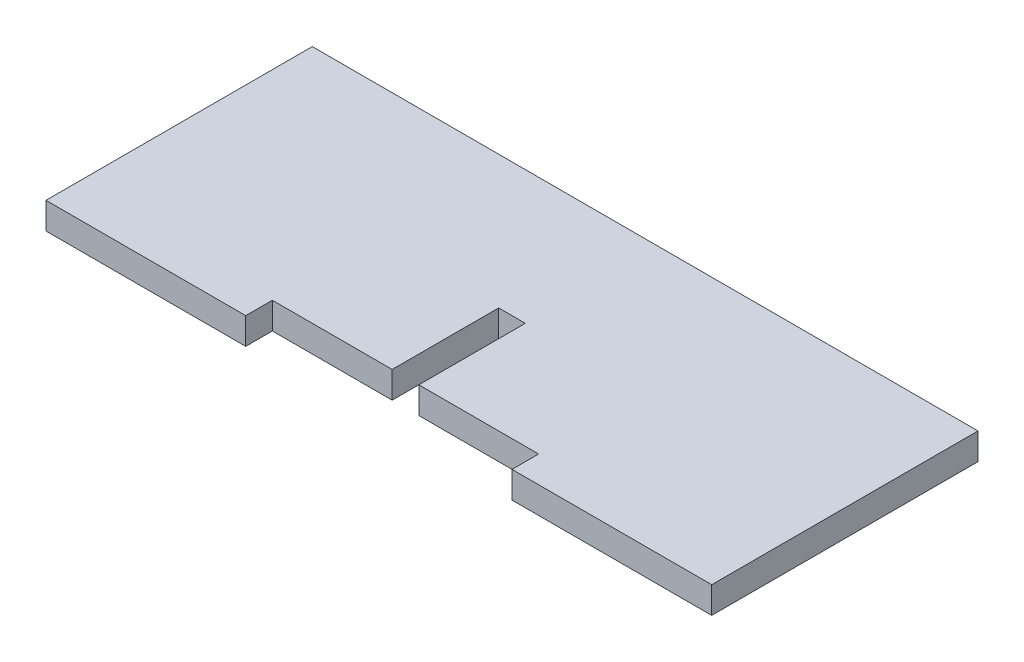
ISO-10303-21;
HEADER;
FILE_DESCRIPTION(('STEP AP214'),'2;1');
FILE_NAME('part.step','',(''),(''),'','','');
FILE_SCHEMA(('AUTOMOTIVE_DESIGN { 1 0 10303 214 1 1 1 1 }'));
ENDSEC;
DATA;
#1=APPLICATION_CONTEXT('core data for automotive mechanical design processes');
#2=APPLICATION_PROTOCOL_DEFINITION('international standard','automotive_design',2000,#1);
#3=PRODUCT_CONTEXT('',#1,'mechanical');
#4=PRODUCT('Part','Part','',(#3));
#5=PRODUCT_RELATED_PRODUCT_CATEGORY('part','',(#4));
#6=PRODUCT_DEFINITION_FORMATION('','',#4);
#7=PRODUCT_DEFINITION_CONTEXT('part definition',#1,'design');
#8=PRODUCT_DEFINITION('design','',#6,#7);
#9=PRODUCT_DEFINITION_SHAPE('','',#8);
#10=(LENGTH_UNIT() NAMED_UNIT(*) SI_UNIT(.MILLI.,.METRE.));
#11=(NAMED_UNIT(*) PLANE_ANGLE_UNIT() SI_UNIT($,.RADIAN.));
#12=(NAMED_UNIT(*) SI_UNIT($,.STERADIAN.) SOLID_ANGLE_UNIT());
#13=UNCERTAINTY_MEASURE_WITH_UNIT(LENGTH_MEASURE(1.E-05),#10,'distance_accuracy_value','');
#14=(GEOMETRIC_REPRESENTATION_CONTEXT(3) GLOBAL_UNCERTAINTY_ASSIGNED_CONTEXT((#13)) GLOBAL_UNIT_ASSIGNED_CONTEXT((#10,
#11,#12)) REPRESENTATION_CONTEXT('',''));
#15=CARTESIAN_POINT('',(0.,0.,0.));
#16=DIRECTION('',(0.,0.,1.));
#17=DIRECTION('',(1.,0.,0.));
#18=AXIS2_PLACEMENT_3D('',#15,#16,#17);
#19=CARTESIAN_POINT('',(-3.,3.,0.));
#20=DIRECTION('',(-1.,0.,0.));
#21=DIRECTION('',(0.,0.,1.));
#22=AXIS2_PLACEMENT_3D('',#19,#20,#21);
#23=PLANE('',#22);
#24=DIRECTION('',(0.,1.,0.));
#25=VECTOR('',#24,1.);
#26=CARTESIAN_POINT('',(-3.,3.,19.6682692307692));
#27=LINE('',#26,#25);
#28=CARTESIAN_POINT('',(-3.,0.,19.6682692307692));
#29=VERTEX_POINT('',#28);
#30=CARTESIAN_POINT('',(-3.,3.,19.6682692307692));
#31=VERTEX_POINT('',#30);
#32=EDGE_CURVE('E205',#29,#31,#27,.T.);
#33=ORIENTED_EDGE('',*,*,#32,.F.);
#34=DIRECTION('',(0.,0.,-1.));
#35=VECTOR('',#34,1.);
#36=CARTESIAN_POINT('',(-3.,0.,0.));
#37=LINE('',#36,#35);
#38=CARTESIAN_POINT('',(-3.,0.,7.66826923076923));
#39=VERTEX_POINT('',#38);
#40=EDGE_CURVE('E171',#29,#39,#37,.T.);
#41=ORIENTED_EDGE('',*,*,#40,.T.);
#42=DIRECTION('',(0.,-1.,0.));
#43=VECTOR('',#42,1.);
#44=CARTESIAN_POINT('',(-3.,3.,7.66826923076923));
#45=LINE('',#44,#43);
#46=CARTESIAN_POINT('',(-3.,3.,7.66826923076923));
#47=VERTEX_POINT('',#46);
#48=EDGE_CURVE('E190',#47,#39,#45,.T.);
#49=ORIENTED_EDGE('',*,*,#48,.F.);
#50=DIRECTION('',(0.,0.,-1.));
#51=VECTOR('',#50,1.);
#52=CARTESIAN_POINT('',(-3.,3.,0.));
#53=LINE('',#52,#51);
#54=EDGE_CURVE('E148',#31,#47,#53,.T.);
#55=ORIENTED_EDGE('',*,*,#54,.F.);
#56=EDGE_LOOP('',(#33,#41,#49,#55));
#57=FACE_BOUND('',#56,.T.);
#58=ADVANCED_FACE('F35',(#57),#23,.F.);
#59=CARTESIAN_POINT('',(0.,3.,0.));
#60=DIRECTION('',(1.,0.,0.));
#61=DIRECTION('',(0.,0.,-1.));
#62=AXIS2_PLACEMENT_3D('',#59,#60,#61);
#63=PLANE('',#62);
#64=DIRECTION('',(0.,-1.,0.));
#65=VECTOR('',#64,1.);
#66=CARTESIAN_POINT('',(0.,3.,19.6682692307692));
#67=LINE('',#66,#65);
#68=CARTESIAN_POINT('',(0.,3.,19.6682692307692));
#69=VERTEX_POINT('',#68);
#70=CARTESIAN_POINT('',(0.,0.,19.6682692307692));
#71=VERTEX_POINT('',#70);
#72=EDGE_CURVE('E58',#69,#71,#67,.T.);
#73=ORIENTED_EDGE('',*,*,#72,.F.);
#74=DIRECTION('',(0.,0.,1.));
#75=VECTOR('',#74,1.);
#76=CARTESIAN_POINT('',(0.,3.,0.));
#77=LINE('',#76,#75);
#78=CARTESIAN_POINT('',(0.,3.,7.66826923076923));
#79=VERTEX_POINT('',#78);
#80=EDGE_CURVE('E157',#79,#69,#77,.T.);
#81=ORIENTED_EDGE('',*,*,#80,.F.);
#82=DIRECTION('',(0.,-1.,0.));
#83=VECTOR('',#82,1.);
#84=CARTESIAN_POINT('',(0.,3.,7.66826923076923));
#85=LINE('',#84,#83);
#86=CARTESIAN_POINT('',(0.,0.,7.66826923076923));
#87=VERTEX_POINT('',#86);
#88=EDGE_CURVE('E187',#79,#87,#85,.T.);
#89=ORIENTED_EDGE('',*,*,#88,.T.);
#90=DIRECTION('',(0.,0.,1.));
#91=VECTOR('',#90,1.);
#92=CARTESIAN_POINT('',(0.,0.,0.));
#93=LINE('',#92,#91);
#94=EDGE_CURVE('E175',#87,#71,#93,.T.);
#95=ORIENTED_EDGE('',*,*,#94,.T.);
#96=EDGE_LOOP('',(#73,#81,#89,#95));
#97=FACE_BOUND('',#96,.T.);
#98=ADVANCED_FACE('F222',(#97),#63,.F.);
#99=CARTESIAN_POINT('',(0.,3.,-7.33173076923077));
#100=DIRECTION('',(0.,0.,-1.));
#101=DIRECTION('',(-1.,0.,0.));
#102=AXIS2_PLACEMENT_3D('',#99,#100,#101);
#103=PLANE('',#102);
#104=DIRECTION('',(1.,0.,0.));
#105=VECTOR('',#104,1.);
#106=CARTESIAN_POINT('',(0.,0.,-7.33173076923077));
#107=LINE('',#106,#105);
#108=CARTESIAN_POINT('',(-39.,0.,-7.33173076923077));
#109=VERTEX_POINT('',#108);
#110=CARTESIAN_POINT('',(36.,0.,-7.33173076923077));
#111=VERTEX_POINT('',#110);
#112=EDGE_CURVE('E130',#109,#111,#107,.T.);
#113=ORIENTED_EDGE('',*,*,#112,.F.);
#114=DIRECTION('',(0.,-1.,0.));
#115=VECTOR('',#114,1.);
#116=CARTESIAN_POINT('',(-39.,3.,-7.33173076923077));
#117=LINE('',#116,#115);
#118=CARTESIAN_POINT('',(-39.,3.,-7.33173076923077));
#119=VERTEX_POINT('',#118);
#120=EDGE_CURVE('E195',#119,#109,#117,.T.);
#121=ORIENTED_EDGE('',*,*,#120,.F.);
#122=DIRECTION('',(1.,0.,0.));
#123=VECTOR('',#122,1.);
#124=CARTESIAN_POINT('',(0.,3.,-7.33173076923077));
#125=LINE('',#124,#123);
#126=CARTESIAN_POINT('',(36.,3.,-7.33173076923077));
#127=VERTEX_POINT('',#126);
#128=EDGE_CURVE('E152',#119,#127,#125,.T.);
#129=ORIENTED_EDGE('',*,*,#128,.T.);
#130=DIRECTION('',(0.,-1.,0.));
#131=VECTOR('',#130,1.);
#132=CARTESIAN_POINT('',(36.,3.,-7.33173076923077));
#133=LINE('',#132,#131);
#134=EDGE_CURVE('E165',#127,#111,#133,.T.);
#135=ORIENTED_EDGE('',*,*,#134,.T.);
#136=EDGE_LOOP('',(#113,#121,#129,#135));
#137=FACE_BOUND('',#136,.T.);
#138=ADVANCED_FACE('F37',(#137),#103,.T.);
#139=CARTESIAN_POINT('',(-39.,3.,0.));
#140=DIRECTION('',(1.,0.,0.));
#141=DIRECTION('',(0.,0.,-1.));
#142=AXIS2_PLACEMENT_3D('',#139,#140,#141);
#143=PLANE('',#142);
#144=DIRECTION('',(0.,0.,1.));
#145=VECTOR('',#144,1.);
#146=CARTESIAN_POINT('',(-39.,0.,0.));
#147=LINE('',#146,#145);
#148=CARTESIAN_POINT('',(-39.,0.,22.6682692307692));
#149=VERTEX_POINT('',#148);
#150=EDGE_CURVE('E168',#109,#149,#147,.T.);
#151=ORIENTED_EDGE('',*,*,#150,.T.);
#152=DIRECTION('',(0.,-1.,0.));
#153=VECTOR('',#152,1.);
#154=CARTESIAN_POINT('',(-39.,3.,22.6682692307692));
#155=LINE('',#154,#153);
#156=CARTESIAN_POINT('',(-39.,3.,22.6682692307692));
#157=VERTEX_POINT('',#156);
#158=EDGE_CURVE('E193',#157,#149,#155,.T.);
#159=ORIENTED_EDGE('',*,*,#158,.F.);
#160=DIRECTION('',(0.,0.,1.));
#161=VECTOR('',#160,1.);
#162=CARTESIAN_POINT('',(-39.,3.,0.));
#163=LINE('',#162,#161);
#164=EDGE_CURVE('E146',#119,#157,#163,.T.);
#165=ORIENTED_EDGE('',*,*,#164,.F.);
#166=ORIENTED_EDGE('',*,*,#120,.T.);
#167=EDGE_LOOP('',(#151,#159,#165,#166));
#168=FACE_BOUND('',#167,.T.);
#169=ADVANCED_FACE('F250',(#168),#143,.F.);
#170=CARTESIAN_POINT('',(0.,3.,22.6682692307692));
#171=DIRECTION('',(0.,0.,-1.));
#172=DIRECTION('',(-1.,0.,0.));
#173=AXIS2_PLACEMENT_3D('',#170,#171,#172);
#174=PLANE('',#173);
#175=DIRECTION('',(1.,0.,0.));
#176=VECTOR('',#175,1.);
#177=CARTESIAN_POINT('',(0.,0.,22.6682692307692));
#178=LINE('',#177,#176);
#179=CARTESIAN_POINT('',(-16.5,0.,22.6682692307692));
#180=VERTEX_POINT('',#179);
#181=EDGE_CURVE('E140',#149,#180,#178,.T.);
#182=ORIENTED_EDGE('',*,*,#181,.T.);
#183=DIRECTION('',(0.,-1.,0.));
#184=VECTOR('',#183,1.);
#185=CARTESIAN_POINT('',(-16.5,8.28074514426581,22.6682692307692));
#186=LINE('',#185,#184);
#187=CARTESIAN_POINT('',(-16.5,3.,22.6682692307692));
#188=VERTEX_POINT('',#187);
#189=EDGE_CURVE('E126',#188,#180,#186,.T.);
#190=ORIENTED_EDGE('',*,*,#189,.F.);
#191=DIRECTION('',(1.,0.,0.));
#192=VECTOR('',#191,1.);
#193=CARTESIAN_POINT('',(0.,3.,22.6682692307692));
#194=LINE('',#193,#192);
#195=EDGE_CURVE('E138',#157,#188,#194,.T.);
#196=ORIENTED_EDGE('',*,*,#195,.F.);
#197=ORIENTED_EDGE('',*,*,#158,.T.);
#198=EDGE_LOOP('',(#182,#190,#196,#197));
#199=FACE_BOUND('',#198,.T.);
#200=ADVANCED_FACE('F136',(#199),#174,.F.);
#201=CARTESIAN_POINT('',(0.,3.,7.66826923076923));
#202=DIRECTION('',(0.,0.,-1.));
#203=DIRECTION('',(-1.,0.,0.));
#204=AXIS2_PLACEMENT_3D('',#201,#202,#203);
#205=PLANE('',#204);
#206=DIRECTION('',(1.,0.,0.));
#207=VECTOR('',#206,1.);
#208=CARTESIAN_POINT('',(0.,0.,7.66826923076923));
#209=LINE('',#208,#207);
#210=EDGE_CURVE('E173',#39,#87,#209,.T.);
#211=ORIENTED_EDGE('',*,*,#210,.T.);
#212=ORIENTED_EDGE('',*,*,#88,.F.);
#213=DIRECTION('',(1.,0.,0.));
#214=VECTOR('',#213,1.);
#215=CARTESIAN_POINT('',(0.,3.,7.66826923076923));
#216=LINE('',#215,#214);
#217=EDGE_CURVE('E150',#47,#79,#216,.T.);
#218=ORIENTED_EDGE('',*,*,#217,.F.);
#219=ORIENTED_EDGE('',*,*,#48,.T.);
#220=EDGE_LOOP('',(#211,#212,#218,#219));
#221=FACE_BOUND('',#220,.T.);
#222=ADVANCED_FACE('F218',(#221),#205,.F.);
#223=CARTESIAN_POINT('',(0.,3.,22.6682692307692));
#224=DIRECTION('',(0.,0.,-1.));
#225=DIRECTION('',(-1.,0.,0.));
#226=AXIS2_PLACEMENT_3D('',#223,#224,#225);
#227=PLANE('',#226);
#228=DIRECTION('',(1.,0.,0.));
#229=VECTOR('',#228,1.);
#230=CARTESIAN_POINT('',(0.,3.,22.6682692307692));
#231=LINE('',#230,#229);
#232=CARTESIAN_POINT('',(13.5,3.,22.6682692307692));
#233=VERTEX_POINT('',#232);
#234=CARTESIAN_POINT('',(36.,3.,22.6682692307692));
#235=VERTEX_POINT('',#234);
#236=EDGE_CURVE('E160',#233,#235,#231,.T.);
#237=ORIENTED_EDGE('',*,*,#236,.F.);
#238=DIRECTION('',(0.,1.,0.));
#239=VECTOR('',#238,1.);
#240=CARTESIAN_POINT('',(13.5,8.28074514426581,22.6682692307692));
#241=LINE('',#240,#239);
#242=CARTESIAN_POINT('',(13.5,0.,22.6682692307692));
#243=VERTEX_POINT('',#242);
#244=EDGE_CURVE('E141',#243,#233,#241,.T.);
#245=ORIENTED_EDGE('',*,*,#244,.F.);
#246=DIRECTION('',(1.,0.,0.));
#247=VECTOR('',#246,1.);
#248=CARTESIAN_POINT('',(0.,0.,22.6682692307692));
#249=LINE('',#248,#247);
#250=CARTESIAN_POINT('',(36.,0.,22.6682692307692));
#251=VERTEX_POINT('',#250);
#252=EDGE_CURVE('E178',#243,#251,#249,.T.);
#253=ORIENTED_EDGE('',*,*,#252,.T.);
#254=DIRECTION('',(0.,-1.,0.));
#255=VECTOR('',#254,1.);
#256=CARTESIAN_POINT('',(36.,3.,22.6682692307692));
#257=LINE('',#256,#255);
#258=EDGE_CURVE('E184',#235,#251,#257,.T.);
#259=ORIENTED_EDGE('',*,*,#258,.F.);
#260=EDGE_LOOP('',(#237,#245,#253,#259));
#261=FACE_BOUND('',#260,.T.);
#262=ADVANCED_FACE('F241',(#261),#227,.F.);
#263=CARTESIAN_POINT('',(36.,3.,0.));
#264=DIRECTION('',(1.,0.,0.));
#265=DIRECTION('',(0.,0.,-1.));
#266=AXIS2_PLACEMENT_3D('',#263,#264,#265);
#267=PLANE('',#266);
#268=DIRECTION('',(0.,0.,1.));
#269=VECTOR('',#268,1.);
#270=CARTESIAN_POINT('',(36.,0.,0.));
#271=LINE('',#270,#269);
#272=EDGE_CURVE('E180',#111,#251,#271,.T.);
#273=ORIENTED_EDGE('',*,*,#272,.F.);
#274=ORIENTED_EDGE('',*,*,#134,.F.);
#275=DIRECTION('',(0.,0.,1.));
#276=VECTOR('',#275,1.);
#277=CARTESIAN_POINT('',(36.,3.,0.));
#278=LINE('',#277,#276);
#279=EDGE_CURVE('E162',#127,#235,#278,.T.);
#280=ORIENTED_EDGE('',*,*,#279,.T.);
#281=ORIENTED_EDGE('',*,*,#258,.T.);
#282=EDGE_LOOP('',(#273,#274,#280,#281));
#283=FACE_BOUND('',#282,.T.);
#284=ADVANCED_FACE('F244',(#283),#267,.T.);
#285=CARTESIAN_POINT('',(0.,3.,0.));
#286=DIRECTION('',(0.,1.,0.));
#287=DIRECTION('',(0.,0.,1.));
#288=AXIS2_PLACEMENT_3D('',#285,#286,#287);
#289=PLANE('',#288);
#290=DIRECTION('',(0.,0.,1.));
#291=VECTOR('',#290,1.);
#292=CARTESIAN_POINT('',(-16.5,3.,0.));
#293=LINE('',#292,#291);
#294=CARTESIAN_POINT('',(-16.5,3.,19.6682692307692));
#295=VERTEX_POINT('',#294);
#296=EDGE_CURVE('E123',#295,#188,#293,.T.);
#297=ORIENTED_EDGE('',*,*,#296,.F.);
#298=DIRECTION('',(1.,0.,0.));
#299=VECTOR('',#298,1.);
#300=CARTESIAN_POINT('',(0.,3.,19.6682692307692));
#301=LINE('',#300,#299);
#302=EDGE_CURVE('E210',#295,#31,#301,.T.);
#303=ORIENTED_EDGE('',*,*,#302,.T.);
#304=ORIENTED_EDGE('',*,*,#54,.T.);
#305=ORIENTED_EDGE('',*,*,#217,.T.);
#306=ORIENTED_EDGE('',*,*,#80,.T.);
#307=CARTESIAN_POINT('',(13.5,3.,19.6682692307692));
#308=VERTEX_POINT('',#307);
#309=EDGE_CURVE('E211',#69,#308,#301,.T.);
#310=ORIENTED_EDGE('',*,*,#309,.T.);
#311=DIRECTION('',(0.,0.,-1.));
#312=VECTOR('',#311,1.);
#313=CARTESIAN_POINT('',(13.5,3.,0.));
#314=LINE('',#313,#312);
#315=EDGE_CURVE('E131',#233,#308,#314,.T.);
#316=ORIENTED_EDGE('',*,*,#315,.F.);
#317=ORIENTED_EDGE('',*,*,#236,.T.);
#318=ORIENTED_EDGE('',*,*,#279,.F.);
#319=ORIENTED_EDGE('',*,*,#128,.F.);
#320=ORIENTED_EDGE('',*,*,#164,.T.);
#321=ORIENTED_EDGE('',*,*,#195,.T.);
#322=EDGE_LOOP('',(#297,#303,#304,#305,#306,#310,#316,#317,#318,#319,#320,#321));
#323=FACE_BOUND('',#322,.T.);
#324=ADVANCED_FACE('F143',(#323),#289,.T.);
#325=CARTESIAN_POINT('',(0.,0.,0.));
#326=DIRECTION('',(0.,1.,0.));
#327=DIRECTION('',(0.,0.,1.));
#328=AXIS2_PLACEMENT_3D('',#325,#326,#327);
#329=PLANE('',#328);
#330=DIRECTION('',(1.,0.,0.));
#331=VECTOR('',#330,1.);
#332=CARTESIAN_POINT('',(0.,0.,19.6682692307692));
#333=LINE('',#332,#331);
#334=CARTESIAN_POINT('',(-16.5,0.,19.6682692307692));
#335=VERTEX_POINT('',#334);
#336=EDGE_CURVE('E43',#335,#29,#333,.T.);
#337=ORIENTED_EDGE('',*,*,#336,.F.);
#338=DIRECTION('',(0.,0.,1.));
#339=VECTOR('',#338,1.);
#340=CARTESIAN_POINT('',(-16.5,0.,0.));
#341=LINE('',#340,#339);
#342=EDGE_CURVE('E11',#335,#180,#341,.T.);
#343=ORIENTED_EDGE('',*,*,#342,.T.);
#344=ORIENTED_EDGE('',*,*,#181,.F.);
#345=ORIENTED_EDGE('',*,*,#150,.F.);
#346=ORIENTED_EDGE('',*,*,#112,.T.);
#347=ORIENTED_EDGE('',*,*,#272,.T.);
#348=ORIENTED_EDGE('',*,*,#252,.F.);
#349=DIRECTION('',(0.,0.,-1.));
#350=VECTOR('',#349,1.);
#351=CARTESIAN_POINT('',(13.5,0.,0.));
#352=LINE('',#351,#350);
#353=CARTESIAN_POINT('',(13.5,0.,19.6682692307692));
#354=VERTEX_POINT('',#353);
#355=EDGE_CURVE('E198',#243,#354,#352,.T.);
#356=ORIENTED_EDGE('',*,*,#355,.T.);
#357=EDGE_CURVE('E197',#71,#354,#333,.T.);
#358=ORIENTED_EDGE('',*,*,#357,.F.);
#359=ORIENTED_EDGE('',*,*,#94,.F.);
#360=ORIENTED_EDGE('',*,*,#210,.F.);
#361=ORIENTED_EDGE('',*,*,#40,.F.);
#362=EDGE_LOOP('',(#337,#343,#344,#345,#346,#347,#348,#356,#358,#359,#360,#361));
#363=FACE_BOUND('',#362,.T.);
#364=ADVANCED_FACE('F214',(#363),#329,.F.);
#365=CARTESIAN_POINT('',(0.,0.,19.6682692307692));
#366=DIRECTION('',(0.,0.,1.));
#367=DIRECTION('',(1.,0.,0.));
#368=AXIS2_PLACEMENT_3D('',#365,#366,#367);
#369=PLANE('',#368);
#370=ORIENTED_EDGE('',*,*,#72,.T.);
#371=ORIENTED_EDGE('',*,*,#357,.T.);
#372=DIRECTION('',(0.,1.,0.));
#373=VECTOR('',#372,1.);
#374=CARTESIAN_POINT('',(13.5,8.28074514426581,19.6682692307692));
#375=LINE('',#374,#373);
#376=EDGE_CURVE('E228',#354,#308,#375,.T.);
#377=ORIENTED_EDGE('',*,*,#376,.T.);
#378=ORIENTED_EDGE('',*,*,#309,.F.);
#379=EDGE_LOOP('',(#370,#371,#377,#378));
#380=FACE_BOUND('',#379,.T.);
#381=ADVANCED_FACE('F272',(#380),#369,.T.);
#382=CARTESIAN_POINT('',(13.5,8.28074514426581,19.6682692307692));
#383=DIRECTION('',(1.,0.,0.));
#384=DIRECTION('',(0.,1.,0.));
#385=AXIS2_PLACEMENT_3D('',#382,#383,#384);
#386=PLANE('',#385);
#387=ORIENTED_EDGE('',*,*,#315,.T.);
#388=ORIENTED_EDGE('',*,*,#376,.F.);
#389=ORIENTED_EDGE('',*,*,#355,.F.);
#390=ORIENTED_EDGE('',*,*,#244,.T.);
#391=EDGE_LOOP('',(#387,#388,#389,#390));
#392=FACE_BOUND('',#391,.T.);
#393=ADVANCED_FACE('F235',(#392),#386,.F.);
#394=CARTESIAN_POINT('',(-16.5,8.28074514426581,19.6682692307692));
#395=DIRECTION('',(-1.,0.,0.));
#396=DIRECTION('',(0.,-1.,0.));
#397=AXIS2_PLACEMENT_3D('',#394,#395,#396);
#398=PLANE('',#397);
#399=ORIENTED_EDGE('',*,*,#296,.T.);
#400=ORIENTED_EDGE('',*,*,#189,.T.);
#401=ORIENTED_EDGE('',*,*,#342,.F.);
#402=DIRECTION('',(0.,-1.,0.));
#403=VECTOR('',#402,1.);
#404=CARTESIAN_POINT('',(-16.5,8.28074514426581,19.6682692307692));
#405=LINE('',#404,#403);
#406=EDGE_CURVE('E50',#295,#335,#405,.T.);
#407=ORIENTED_EDGE('',*,*,#406,.F.);
#408=EDGE_LOOP('',(#399,#400,#401,#407));
#409=FACE_BOUND('',#408,.T.);
#410=ADVANCED_FACE('F125',(#409),#398,.F.);
#411=ORIENTED_EDGE('',*,*,#406,.T.);
#412=ORIENTED_EDGE('',*,*,#336,.T.);
#413=ORIENTED_EDGE('',*,*,#32,.T.);
#414=ORIENTED_EDGE('',*,*,#302,.F.);
#415=EDGE_LOOP('',(#411,#412,#413,#414));
#416=FACE_BOUND('',#415,.T.);
#417=ADVANCED_FACE('F204',(#416),#369,.T.);
#418=CLOSED_SHELL('',(#58,#98,#138,#169,#200,#222,#262,#284,#324,#364,#381,#393,#410,#417));
#419=MANIFOLD_SOLID_BREP('B2',#418);
#420=ADVANCED_BREP_SHAPE_REPRESENTATION('',(#18,#419),#14);
#421=SHAPE_DEFINITION_REPRESENTATION(#9,#420);
ENDSEC;
END-ISO-10303-21;
